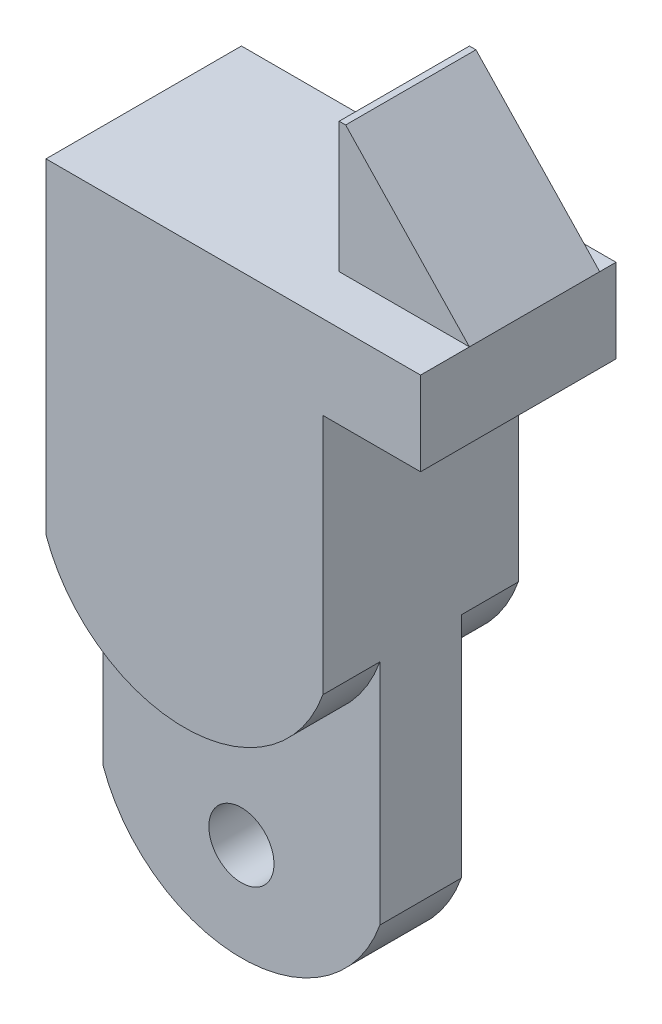
ISO-10303-21;
HEADER;
FILE_DESCRIPTION(('STEP AP214'),'2;1');
FILE_NAME('part.step','',(''),(''),'','','');
FILE_SCHEMA(('AUTOMOTIVE_DESIGN { 1 0 10303 214 1 1 1 1 }'));
ENDSEC;
DATA;
#1=APPLICATION_CONTEXT('core data for automotive mechanical design processes');
#2=APPLICATION_PROTOCOL_DEFINITION('international standard','automotive_design',2000,#1);
#3=PRODUCT_CONTEXT('',#1,'mechanical');
#4=PRODUCT('Part','Part','',(#3));
#5=PRODUCT_RELATED_PRODUCT_CATEGORY('part','',(#4));
#6=PRODUCT_DEFINITION_FORMATION('','',#4);
#7=PRODUCT_DEFINITION_CONTEXT('part definition',#1,'design');
#8=PRODUCT_DEFINITION('design','',#6,#7);
#9=PRODUCT_DEFINITION_SHAPE('','',#8);
#10=(LENGTH_UNIT() NAMED_UNIT(*) SI_UNIT(.MILLI.,.METRE.));
#11=(NAMED_UNIT(*) PLANE_ANGLE_UNIT() SI_UNIT($,.RADIAN.));
#12=(NAMED_UNIT(*) SI_UNIT($,.STERADIAN.) SOLID_ANGLE_UNIT());
#13=UNCERTAINTY_MEASURE_WITH_UNIT(LENGTH_MEASURE(1.E-05),#10,'distance_accuracy_value','');
#14=(GEOMETRIC_REPRESENTATION_CONTEXT(3) GLOBAL_UNCERTAINTY_ASSIGNED_CONTEXT((#13)) GLOBAL_UNIT_ASSIGNED_CONTEXT((#10,
#11,#12)) REPRESENTATION_CONTEXT('',''));
#15=CARTESIAN_POINT('',(0.,0.,0.));
#16=DIRECTION('',(0.,0.,1.));
#17=DIRECTION('',(1.,0.,0.));
#18=AXIS2_PLACEMENT_3D('',#15,#16,#17);
#19=CARTESIAN_POINT('',(0.,0.,6.));
#20=DIRECTION('',(0.,-1.,0.));
#21=DIRECTION('',(0.,0.,-1.));
#22=AXIS2_PLACEMENT_3D('',#19,#20,#21);
#23=PLANE('',#22);
#24=DIRECTION('',(1.,0.,0.));
#25=VECTOR('',#24,1.);
#26=CARTESIAN_POINT('',(11.5,0.,4.5));
#27=LINE('',#26,#25);
#28=CARTESIAN_POINT('',(7.5,0.,4.5));
#29=VERTEX_POINT('',#28);
#30=CARTESIAN_POINT('',(11.5,0.,4.5));
#31=VERTEX_POINT('',#30);
#32=EDGE_CURVE('E57',#29,#31,#27,.T.);
#33=ORIENTED_EDGE('',*,*,#32,.F.);
#34=DIRECTION('',(0.,0.,1.));
#35=VECTOR('',#34,1.);
#36=CARTESIAN_POINT('',(7.5,0.,0.500000000000001));
#37=LINE('',#36,#35);
#38=CARTESIAN_POINT('',(7.5,0.,0.500000000000001));
#39=VERTEX_POINT('',#38);
#40=EDGE_CURVE('E153',#39,#29,#37,.T.);
#41=ORIENTED_EDGE('',*,*,#40,.F.);
#42=DIRECTION('',(-1.,0.,0.));
#43=VECTOR('',#42,1.);
#44=CARTESIAN_POINT('',(11.5,0.,0.5));
#45=LINE('',#44,#43);
#46=CARTESIAN_POINT('',(11.5,0.,0.500000000000003));
#47=VERTEX_POINT('',#46);
#48=EDGE_CURVE('E141',#47,#39,#45,.T.);
#49=ORIENTED_EDGE('',*,*,#48,.F.);
#50=DIRECTION('',(0.,0.,-1.));
#51=VECTOR('',#50,1.);
#52=CARTESIAN_POINT('',(11.5,0.,6.));
#53=LINE('',#52,#51);
#54=CARTESIAN_POINT('',(11.5,0.,0.));
#55=VERTEX_POINT('',#54);
#56=EDGE_CURVE('E42',#47,#55,#53,.T.);
#57=ORIENTED_EDGE('',*,*,#56,.T.);
#58=DIRECTION('',(-1.,0.,0.));
#59=VECTOR('',#58,1.);
#60=CARTESIAN_POINT('',(0.,0.,0.));
#61=LINE('',#60,#59);
#62=CARTESIAN_POINT('',(0.,0.,0.));
#63=VERTEX_POINT('',#62);
#64=EDGE_CURVE('E170',#55,#63,#61,.T.);
#65=ORIENTED_EDGE('',*,*,#64,.T.);
#66=DIRECTION('',(0.,0.,-1.));
#67=VECTOR('',#66,1.);
#68=CARTESIAN_POINT('',(0.,0.,6.));
#69=LINE('',#68,#67);
#70=CARTESIAN_POINT('',(0.,0.,6.));
#71=VERTEX_POINT('',#70);
#72=EDGE_CURVE('E160',#71,#63,#69,.T.);
#73=ORIENTED_EDGE('',*,*,#72,.F.);
#74=DIRECTION('',(-1.,0.,0.));
#75=VECTOR('',#74,1.);
#76=CARTESIAN_POINT('',(0.,0.,6.));
#77=LINE('',#76,#75);
#78=CARTESIAN_POINT('',(11.5,0.,6.));
#79=VERTEX_POINT('',#78);
#80=EDGE_CURVE('E163',#79,#71,#77,.T.);
#81=ORIENTED_EDGE('',*,*,#80,.F.);
#82=EDGE_CURVE('E11',#79,#31,#53,.T.);
#83=ORIENTED_EDGE('',*,*,#82,.T.);
#84=EDGE_LOOP('',(#33,#41,#49,#57,#65,#73,#81,#83));
#85=FACE_BOUND('',#84,.T.);
#86=ADVANCED_FACE('F33',(#85),#23,.F.);
#87=CARTESIAN_POINT('',(4.25,-8.48958333333333,4.25));
#88=DIRECTION('',(0.,0.,1.));
#89=DIRECTION('',(1.,0.,0.));
#90=AXIS2_PLACEMENT_3D('',#87,#88,#89);
#91=PLANE('',#90);
#92=CARTESIAN_POINT('',(4.25,-17.,4.25));
#93=DIRECTION('',(0.,0.,-1.));
#94=DIRECTION('',(-1.,0.,0.));
#95=AXIS2_PLACEMENT_3D('',#92,#93,#94);
#96=CIRCLE('',#95,1.);
#97=CARTESIAN_POINT('',(3.25,-17.,4.25));
#98=VERTEX_POINT('',#97);
#99=EDGE_CURVE('E240',#98,#98,#96,.T.);
#100=ORIENTED_EDGE('',*,*,#99,.T.);
#101=EDGE_LOOP('',(#100));
#102=FACE_BOUND('',#101,.T.);
#103=DIRECTION('',(0.,-1.,0.));
#104=VECTOR('',#103,1.);
#105=CARTESIAN_POINT('',(0.,-10.,4.25));
#106=LINE('',#105,#104);
#107=CARTESIAN_POINT('',(0.,-10.,4.25));
#108=VERTEX_POINT('',#107);
#109=CARTESIAN_POINT('',(0.,-17.,4.25));
#110=VERTEX_POINT('',#109);
#111=EDGE_CURVE('E209',#108,#110,#106,.T.);
#112=ORIENTED_EDGE('',*,*,#111,.T.);
#113=CARTESIAN_POINT('',(4.25,-15.4895833333333,4.25));
#114=DIRECTION('',(0.,0.,-1.));
#115=DIRECTION('',(-1.,0.,0.));
#116=AXIS2_PLACEMENT_3D('',#113,#114,#115);
#117=CIRCLE('',#116,4.51041666666667);
#118=CARTESIAN_POINT('',(8.5,-17.,4.25));
#119=VERTEX_POINT('',#118);
#120=EDGE_CURVE('E233',#119,#110,#117,.T.);
#121=ORIENTED_EDGE('',*,*,#120,.F.);
#122=DIRECTION('',(0.,1.,0.));
#123=VECTOR('',#122,1.);
#124=CARTESIAN_POINT('',(8.5,-20.,4.25));
#125=LINE('',#124,#123);
#126=CARTESIAN_POINT('',(8.5,-10.,4.25));
#127=VERTEX_POINT('',#126);
#128=EDGE_CURVE('E202',#119,#127,#125,.T.);
#129=ORIENTED_EDGE('',*,*,#128,.T.);
#130=CARTESIAN_POINT('',(4.25,-8.48958333333333,4.25));
#131=DIRECTION('',(0.,0.,-1.));
#132=DIRECTION('',(1.,0.,0.));
#133=AXIS2_PLACEMENT_3D('',#130,#131,#132);
#134=CIRCLE('',#133,4.51041666666667);
#135=EDGE_CURVE('E206',#127,#108,#134,.T.);
#136=ORIENTED_EDGE('',*,*,#135,.T.);
#137=EDGE_LOOP('',(#112,#121,#129,#136));
#138=FACE_BOUND('',#137,.T.);
#139=ADVANCED_FACE('F285',(#102,#138),#91,.T.);
#140=CARTESIAN_POINT('',(0.,0.,1.75));
#141=DIRECTION('',(0.,0.,1.));
#142=DIRECTION('',(1.,0.,0.));
#143=AXIS2_PLACEMENT_3D('',#140,#141,#142);
#144=PLANE('',#143);
#145=CARTESIAN_POINT('',(4.25,-17.,1.75));
#146=DIRECTION('',(0.,0.,-1.));
#147=DIRECTION('',(-1.,0.,0.));
#148=AXIS2_PLACEMENT_3D('',#145,#146,#147);
#149=CIRCLE('',#148,1.);
#150=CARTESIAN_POINT('',(3.25,-17.,1.75));
#151=VERTEX_POINT('',#150);
#152=EDGE_CURVE('E241',#151,#151,#149,.T.);
#153=ORIENTED_EDGE('',*,*,#152,.F.);
#154=EDGE_LOOP('',(#153));
#155=FACE_BOUND('',#154,.T.);
#156=CARTESIAN_POINT('',(4.25,-15.4895833333333,1.75));
#157=DIRECTION('',(0.,0.,-1.));
#158=DIRECTION('',(-1.,0.,0.));
#159=AXIS2_PLACEMENT_3D('',#156,#157,#158);
#160=CIRCLE('',#159,4.51041666666667);
#161=CARTESIAN_POINT('',(8.5,-17.,1.75));
#162=VERTEX_POINT('',#161);
#163=CARTESIAN_POINT('',(0.,-17.,1.75));
#164=VERTEX_POINT('',#163);
#165=EDGE_CURVE('E234',#162,#164,#160,.T.);
#166=ORIENTED_EDGE('',*,*,#165,.T.);
#167=DIRECTION('',(0.,-1.,0.));
#168=VECTOR('',#167,1.);
#169=CARTESIAN_POINT('',(0.,0.,1.75));
#170=LINE('',#169,#168);
#171=CARTESIAN_POINT('',(0.,-10.,1.75));
#172=VERTEX_POINT('',#171);
#173=EDGE_CURVE('E214',#172,#164,#170,.T.);
#174=ORIENTED_EDGE('',*,*,#173,.F.);
#175=CARTESIAN_POINT('',(4.25,-8.48958333333333,1.75));
#176=DIRECTION('',(0.,0.,1.));
#177=DIRECTION('',(1.,0.,0.));
#178=AXIS2_PLACEMENT_3D('',#175,#176,#177);
#179=CIRCLE('',#178,4.51041666666667);
#180=CARTESIAN_POINT('',(8.5,-10.,1.75));
#181=VERTEX_POINT('',#180);
#182=EDGE_CURVE('E226',#181,#172,#179,.F.);
#183=ORIENTED_EDGE('',*,*,#182,.F.);
#184=DIRECTION('',(0.,-1.,0.));
#185=VECTOR('',#184,1.);
#186=CARTESIAN_POINT('',(8.5,-2.5709966238269,1.75));
#187=LINE('',#186,#185);
#188=EDGE_CURVE('E218',#181,#162,#187,.T.);
#189=ORIENTED_EDGE('',*,*,#188,.T.);
#190=EDGE_LOOP('',(#166,#174,#183,#189));
#191=FACE_BOUND('',#190,.T.);
#192=ADVANCED_FACE('F290',(#155,#191),#144,.F.);
#193=CARTESIAN_POINT('',(0.,0.,6.));
#194=DIRECTION('',(1.,0.,0.));
#195=DIRECTION('',(0.,1.,0.));
#196=AXIS2_PLACEMENT_3D('',#193,#194,#195);
#197=PLANE('',#196);
#198=DIRECTION('',(0.,0.,-1.));
#199=VECTOR('',#198,1.);
#200=CARTESIAN_POINT('',(0.,-17.,4.25));
#201=LINE('',#200,#199);
#202=EDGE_CURVE('E236',#110,#164,#201,.T.);
#203=ORIENTED_EDGE('',*,*,#202,.F.);
#204=ORIENTED_EDGE('',*,*,#111,.F.);
#205=DIRECTION('',(0.,0.,1.));
#206=VECTOR('',#205,1.);
#207=CARTESIAN_POINT('',(0.,-10.,4.25));
#208=LINE('',#207,#206);
#209=CARTESIAN_POINT('',(0.,-10.,6.));
#210=VERTEX_POINT('',#209);
#211=EDGE_CURVE('E199',#108,#210,#208,.T.);
#212=ORIENTED_EDGE('',*,*,#211,.T.);
#213=DIRECTION('',(0.,-1.,0.));
#214=VECTOR('',#213,1.);
#215=CARTESIAN_POINT('',(0.,0.,6.));
#216=LINE('',#215,#214);
#217=EDGE_CURVE('E172',#71,#210,#216,.T.);
#218=ORIENTED_EDGE('',*,*,#217,.F.);
#219=ORIENTED_EDGE('',*,*,#72,.T.);
#220=DIRECTION('',(0.,-1.,0.));
#221=VECTOR('',#220,1.);
#222=CARTESIAN_POINT('',(0.,0.,0.));
#223=LINE('',#222,#221);
#224=CARTESIAN_POINT('',(0.,-10.,0.));
#225=VERTEX_POINT('',#224);
#226=EDGE_CURVE('E174',#63,#225,#223,.T.);
#227=ORIENTED_EDGE('',*,*,#226,.T.);
#228=DIRECTION('',(0.,0.,1.));
#229=VECTOR('',#228,1.);
#230=CARTESIAN_POINT('',(0.,-10.,-35.1099936026505));
#231=LINE('',#230,#229);
#232=EDGE_CURVE('E207',#225,#172,#231,.T.);
#233=ORIENTED_EDGE('',*,*,#232,.T.);
#234=ORIENTED_EDGE('',*,*,#173,.T.);
#235=EDGE_LOOP('',(#203,#204,#212,#218,#219,#227,#233,#234));
#236=FACE_BOUND('',#235,.T.);
#237=ADVANCED_FACE('F35',(#236),#197,.F.);
#238=CARTESIAN_POINT('',(8.5,-2.5709966238269,0.));
#239=DIRECTION('',(-1.,0.,0.));
#240=DIRECTION('',(0.,-1.,0.));
#241=AXIS2_PLACEMENT_3D('',#238,#239,#240);
#242=PLANE('',#241);
#243=DIRECTION('',(0.,0.,-1.));
#244=VECTOR('',#243,1.);
#245=CARTESIAN_POINT('',(8.5,-17.,4.25));
#246=LINE('',#245,#244);
#247=EDGE_CURVE('E221',#119,#162,#246,.T.);
#248=ORIENTED_EDGE('',*,*,#247,.T.);
#249=ORIENTED_EDGE('',*,*,#188,.F.);
#250=DIRECTION('',(0.,0.,1.));
#251=VECTOR('',#250,1.);
#252=CARTESIAN_POINT('',(8.5,-10.,-35.1099936026505));
#253=LINE('',#252,#251);
#254=CARTESIAN_POINT('',(8.5,-10.,0.));
#255=VERTEX_POINT('',#254);
#256=EDGE_CURVE('E224',#255,#181,#253,.T.);
#257=ORIENTED_EDGE('',*,*,#256,.F.);
#258=DIRECTION('',(0.,-1.,0.));
#259=VECTOR('',#258,1.);
#260=CARTESIAN_POINT('',(8.5,-2.5709966238269,0.));
#261=LINE('',#260,#259);
#262=CARTESIAN_POINT('',(8.5,-2.5709966238269,0.));
#263=VERTEX_POINT('',#262);
#264=EDGE_CURVE('E185',#263,#255,#261,.T.);
#265=ORIENTED_EDGE('',*,*,#264,.F.);
#266=DIRECTION('',(0.,0.,1.));
#267=VECTOR('',#266,1.);
#268=CARTESIAN_POINT('',(8.5,-2.5709966238269,0.));
#269=LINE('',#268,#267);
#270=CARTESIAN_POINT('',(8.5,-2.5709966238269,6.));
#271=VERTEX_POINT('',#270);
#272=EDGE_CURVE('E177',#263,#271,#269,.T.);
#273=ORIENTED_EDGE('',*,*,#272,.T.);
#274=DIRECTION('',(0.,-1.,0.));
#275=VECTOR('',#274,1.);
#276=CARTESIAN_POINT('',(8.5,-2.5709966238269,6.));
#277=LINE('',#276,#275);
#278=CARTESIAN_POINT('',(8.5,-10.,6.));
#279=VERTEX_POINT('',#278);
#280=EDGE_CURVE('E187',#271,#279,#277,.T.);
#281=ORIENTED_EDGE('',*,*,#280,.T.);
#282=DIRECTION('',(0.,0.,1.));
#283=VECTOR('',#282,1.);
#284=CARTESIAN_POINT('',(8.5,-10.,4.25));
#285=LINE('',#284,#283);
#286=EDGE_CURVE('E194',#127,#279,#285,.T.);
#287=ORIENTED_EDGE('',*,*,#286,.F.);
#288=ORIENTED_EDGE('',*,*,#128,.F.);
#289=EDGE_LOOP('',(#248,#249,#257,#265,#273,#281,#287,#288));
#290=FACE_BOUND('',#289,.T.);
#291=ADVANCED_FACE('F304',(#290),#242,.F.);
#292=CARTESIAN_POINT('',(0.,0.,0.));
#293=DIRECTION('',(0.,0.,1.));
#294=DIRECTION('',(1.,0.,0.));
#295=AXIS2_PLACEMENT_3D('',#292,#293,#294);
#296=PLANE('',#295);
#297=CARTESIAN_POINT('',(4.25,-8.48958333333333,0.));
#298=DIRECTION('',(0.,0.,1.));
#299=DIRECTION('',(1.,0.,0.));
#300=AXIS2_PLACEMENT_3D('',#297,#298,#299);
#301=CIRCLE('',#300,4.51041666666667);
#302=EDGE_CURVE('E217',#255,#225,#301,.F.);
#303=ORIENTED_EDGE('',*,*,#302,.T.);
#304=ORIENTED_EDGE('',*,*,#226,.F.);
#305=ORIENTED_EDGE('',*,*,#64,.F.);
#306=DIRECTION('',(0.,1.,0.));
#307=VECTOR('',#306,1.);
#308=CARTESIAN_POINT('',(11.5,0.,0.));
#309=LINE('',#308,#307);
#310=CARTESIAN_POINT('',(11.5,-2.5709966238269,0.));
#311=VERTEX_POINT('',#310);
#312=EDGE_CURVE('E158',#311,#55,#309,.T.);
#313=ORIENTED_EDGE('',*,*,#312,.F.);
#314=DIRECTION('',(-1.,0.,0.));
#315=VECTOR('',#314,1.);
#316=CARTESIAN_POINT('',(11.5,-2.5709966238269,0.));
#317=LINE('',#316,#315);
#318=EDGE_CURVE('E190',#311,#263,#317,.T.);
#319=ORIENTED_EDGE('',*,*,#318,.T.);
#320=ORIENTED_EDGE('',*,*,#264,.T.);
#321=EDGE_LOOP('',(#303,#304,#305,#313,#319,#320));
#322=FACE_BOUND('',#321,.T.);
#323=ADVANCED_FACE('F294',(#322),#296,.F.);
#324=CARTESIAN_POINT('',(11.5,0.,6.));
#325=DIRECTION('',(-1.,0.,0.));
#326=DIRECTION('',(0.,-1.,0.));
#327=AXIS2_PLACEMENT_3D('',#324,#325,#326);
#328=PLANE('',#327);
#329=ORIENTED_EDGE('',*,*,#56,.F.);
#330=DIRECTION('',(0.,0.,1.));
#331=VECTOR('',#330,1.);
#332=CARTESIAN_POINT('',(11.5,0.,0.500000000000003));
#333=LINE('',#332,#331);
#334=EDGE_CURVE('E134',#47,#31,#333,.T.);
#335=ORIENTED_EDGE('',*,*,#334,.T.);
#336=ORIENTED_EDGE('',*,*,#82,.F.);
#337=DIRECTION('',(0.,1.,0.));
#338=VECTOR('',#337,1.);
#339=CARTESIAN_POINT('',(11.5,0.,6.));
#340=LINE('',#339,#338);
#341=CARTESIAN_POINT('',(11.5,-2.5709966238269,6.));
#342=VERTEX_POINT('',#341);
#343=EDGE_CURVE('E179',#342,#79,#340,.T.);
#344=ORIENTED_EDGE('',*,*,#343,.F.);
#345=DIRECTION('',(0.,0.,1.));
#346=VECTOR('',#345,1.);
#347=CARTESIAN_POINT('',(11.5,-2.5709966238269,0.));
#348=LINE('',#347,#346);
#349=EDGE_CURVE('E183',#311,#342,#348,.T.);
#350=ORIENTED_EDGE('',*,*,#349,.F.);
#351=ORIENTED_EDGE('',*,*,#312,.T.);
#352=EDGE_LOOP('',(#329,#335,#336,#344,#350,#351));
#353=FACE_BOUND('',#352,.T.);
#354=ADVANCED_FACE('F155',(#353),#328,.F.);
#355=CARTESIAN_POINT('',(0.,0.,6.));
#356=DIRECTION('',(0.,0.,1.));
#357=DIRECTION('',(1.,0.,0.));
#358=AXIS2_PLACEMENT_3D('',#355,#356,#357);
#359=PLANE('',#358);
#360=CARTESIAN_POINT('',(4.25,-8.48958333333333,6.));
#361=DIRECTION('',(0.,0.,-1.));
#362=DIRECTION('',(1.,0.,0.));
#363=AXIS2_PLACEMENT_3D('',#360,#361,#362);
#364=CIRCLE('',#363,4.51041666666667);
#365=EDGE_CURVE('E204',#279,#210,#364,.T.);
#366=ORIENTED_EDGE('',*,*,#365,.F.);
#367=ORIENTED_EDGE('',*,*,#280,.F.);
#368=DIRECTION('',(-1.,0.,0.));
#369=VECTOR('',#368,1.);
#370=CARTESIAN_POINT('',(11.5,-2.5709966238269,6.));
#371=LINE('',#370,#369);
#372=EDGE_CURVE('E191',#342,#271,#371,.T.);
#373=ORIENTED_EDGE('',*,*,#372,.F.);
#374=ORIENTED_EDGE('',*,*,#343,.T.);
#375=ORIENTED_EDGE('',*,*,#80,.T.);
#376=ORIENTED_EDGE('',*,*,#217,.T.);
#377=EDGE_LOOP('',(#366,#367,#373,#374,#375,#376));
#378=FACE_BOUND('',#377,.T.);
#379=ADVANCED_FACE('F297',(#378),#359,.T.);
#380=CARTESIAN_POINT('',(11.5,-2.5709966238269,0.));
#381=DIRECTION('',(0.,1.,0.));
#382=DIRECTION('',(-1.,0.,0.));
#383=AXIS2_PLACEMENT_3D('',#380,#381,#382);
#384=PLANE('',#383);
#385=ORIENTED_EDGE('',*,*,#372,.T.);
#386=ORIENTED_EDGE('',*,*,#272,.F.);
#387=ORIENTED_EDGE('',*,*,#318,.F.);
#388=ORIENTED_EDGE('',*,*,#349,.T.);
#389=EDGE_LOOP('',(#385,#386,#387,#388));
#390=FACE_BOUND('',#389,.T.);
#391=ADVANCED_FACE('F302',(#390),#384,.F.);
#392=CARTESIAN_POINT('',(4.25,-8.48958333333333,4.25));
#393=DIRECTION('',(0.,0.,1.));
#394=DIRECTION('',(1.,0.,0.));
#395=AXIS2_PLACEMENT_3D('',#392,#393,#394);
#396=CYLINDRICAL_SURFACE('',#395,4.51041666666667);
#397=ORIENTED_EDGE('',*,*,#365,.T.);
#398=ORIENTED_EDGE('',*,*,#211,.F.);
#399=ORIENTED_EDGE('',*,*,#135,.F.);
#400=ORIENTED_EDGE('',*,*,#286,.T.);
#401=EDGE_LOOP('',(#397,#398,#399,#400));
#402=FACE_BOUND('',#401,.T.);
#403=ADVANCED_FACE('F337',(#402),#396,.T.);
#404=CARTESIAN_POINT('',(4.25,-8.48958333333333,-35.1099936026505));
#405=DIRECTION('',(0.,0.,1.));
#406=DIRECTION('',(1.,0.,0.));
#407=AXIS2_PLACEMENT_3D('',#404,#405,#406);
#408=CYLINDRICAL_SURFACE('',#407,4.51041666666667);
#409=ORIENTED_EDGE('',*,*,#302,.F.);
#410=ORIENTED_EDGE('',*,*,#256,.T.);
#411=ORIENTED_EDGE('',*,*,#182,.T.);
#412=ORIENTED_EDGE('',*,*,#232,.F.);
#413=EDGE_LOOP('',(#409,#410,#411,#412));
#414=FACE_BOUND('',#413,.T.);
#415=ADVANCED_FACE('F329',(#414),#408,.T.);
#416=CARTESIAN_POINT('',(4.25,-15.4895833333333,4.25));
#417=DIRECTION('',(0.,0.,-1.));
#418=DIRECTION('',(-1.,0.,0.));
#419=AXIS2_PLACEMENT_3D('',#416,#417,#418);
#420=CYLINDRICAL_SURFACE('',#419,4.51041666666667);
#421=ORIENTED_EDGE('',*,*,#165,.F.);
#422=ORIENTED_EDGE('',*,*,#247,.F.);
#423=ORIENTED_EDGE('',*,*,#120,.T.);
#424=ORIENTED_EDGE('',*,*,#202,.T.);
#425=EDGE_LOOP('',(#421,#422,#423,#424));
#426=FACE_BOUND('',#425,.T.);
#427=ADVANCED_FACE('F344',(#426),#420,.T.);
#428=CARTESIAN_POINT('',(4.25,-17.,4.25));
#429=DIRECTION('',(0.,0.,-1.));
#430=DIRECTION('',(-1.,0.,0.));
#431=AXIS2_PLACEMENT_3D('',#428,#429,#430);
#432=CYLINDRICAL_SURFACE('',#431,1.);
#433=ORIENTED_EDGE('',*,*,#99,.F.);
#434=EDGE_LOOP('',(#433));
#435=FACE_BOUND('',#434,.T.);
#436=ORIENTED_EDGE('',*,*,#152,.T.);
#437=EDGE_LOOP('',(#436));
#438=FACE_BOUND('',#437,.T.);
#439=ADVANCED_FACE('F353',(#435,#438),#432,.F.);
#440=CARTESIAN_POINT('',(11.5,4.,0.5));
#441=DIRECTION('',(0.,0.,1.));
#442=DIRECTION('',(1.,0.,0.));
#443=AXIS2_PLACEMENT_3D('',#440,#441,#442);
#444=PLANE('',#443);
#445=DIRECTION('',(-1.,0.,0.));
#446=VECTOR('',#445,1.);
#447=CARTESIAN_POINT('',(11.5,4.,0.5));
#448=LINE('',#447,#446);
#449=CARTESIAN_POINT('',(7.7,4.,0.500000000000001));
#450=VERTEX_POINT('',#449);
#451=CARTESIAN_POINT('',(7.5,4.,0.500000000000001));
#452=VERTEX_POINT('',#451);
#453=EDGE_CURVE('E151',#450,#452,#448,.T.);
#454=ORIENTED_EDGE('',*,*,#453,.F.);
#455=DIRECTION('',(0.688749461914693,-0.724999433594414,0.));
#456=VECTOR('',#455,1.);
#457=CARTESIAN_POINT('',(7.7,4.,0.500000000000003));
#458=LINE('',#457,#456);
#459=EDGE_CURVE('E50',#450,#47,#458,.T.);
#460=ORIENTED_EDGE('',*,*,#459,.T.);
#461=ORIENTED_EDGE('',*,*,#48,.T.);
#462=DIRECTION('',(0.,-1.,0.));
#463=VECTOR('',#462,1.);
#464=CARTESIAN_POINT('',(7.5,4.,0.500000000000001));
#465=LINE('',#464,#463);
#466=EDGE_CURVE('E244',#452,#39,#465,.T.);
#467=ORIENTED_EDGE('',*,*,#466,.F.);
#468=EDGE_LOOP('',(#454,#460,#461,#467));
#469=FACE_BOUND('',#468,.T.);
#470=ADVANCED_FACE('F148',(#469),#444,.F.);
#471=CARTESIAN_POINT('',(7.5,4.,0.500000000000001));
#472=DIRECTION('',(1.,0.,0.));
#473=DIRECTION('',(0.,0.,-1.));
#474=AXIS2_PLACEMENT_3D('',#471,#472,#473);
#475=PLANE('',#474);
#476=ORIENTED_EDGE('',*,*,#40,.T.);
#477=DIRECTION('',(0.,-1.,0.));
#478=VECTOR('',#477,1.);
#479=CARTESIAN_POINT('',(7.5,4.,4.5));
#480=LINE('',#479,#478);
#481=CARTESIAN_POINT('',(7.5,4.,4.5));
#482=VERTEX_POINT('',#481);
#483=EDGE_CURVE('E248',#482,#29,#480,.T.);
#484=ORIENTED_EDGE('',*,*,#483,.F.);
#485=DIRECTION('',(0.,0.,1.));
#486=VECTOR('',#485,1.);
#487=CARTESIAN_POINT('',(7.5,4.,0.500000000000001));
#488=LINE('',#487,#486);
#489=EDGE_CURVE('E263',#452,#482,#488,.T.);
#490=ORIENTED_EDGE('',*,*,#489,.F.);
#491=ORIENTED_EDGE('',*,*,#466,.T.);
#492=EDGE_LOOP('',(#476,#484,#490,#491));
#493=FACE_BOUND('',#492,.T.);
#494=ADVANCED_FACE('F267',(#493),#475,.F.);
#495=CARTESIAN_POINT('',(11.5,4.,4.5));
#496=DIRECTION('',(0.,0.,-1.));
#497=DIRECTION('',(-1.,0.,0.));
#498=AXIS2_PLACEMENT_3D('',#495,#496,#497);
#499=PLANE('',#498);
#500=ORIENTED_EDGE('',*,*,#32,.T.);
#501=DIRECTION('',(0.688749461914693,-0.724999433594414,0.));
#502=VECTOR('',#501,1.);
#503=CARTESIAN_POINT('',(7.7,4.,4.5));
#504=LINE('',#503,#502);
#505=CARTESIAN_POINT('',(7.7,4.,4.5));
#506=VERTEX_POINT('',#505);
#507=EDGE_CURVE('E137',#506,#31,#504,.T.);
#508=ORIENTED_EDGE('',*,*,#507,.F.);
#509=DIRECTION('',(1.,0.,0.));
#510=VECTOR('',#509,1.);
#511=CARTESIAN_POINT('',(11.5,4.,4.5));
#512=LINE('',#511,#510);
#513=EDGE_CURVE('E251',#482,#506,#512,.T.);
#514=ORIENTED_EDGE('',*,*,#513,.F.);
#515=ORIENTED_EDGE('',*,*,#483,.T.);
#516=EDGE_LOOP('',(#500,#508,#514,#515));
#517=FACE_BOUND('',#516,.T.);
#518=ADVANCED_FACE('F270',(#517),#499,.F.);
#519=CARTESIAN_POINT('',(0.,4.,0.));
#520=DIRECTION('',(0.,-1.,0.));
#521=DIRECTION('',(0.,0.,-1.));
#522=AXIS2_PLACEMENT_3D('',#519,#520,#521);
#523=PLANE('',#522);
#524=ORIENTED_EDGE('',*,*,#513,.T.);
#525=DIRECTION('',(0.,0.,1.));
#526=VECTOR('',#525,1.);
#527=CARTESIAN_POINT('',(7.7,4.,0.500000000000003));
#528=LINE('',#527,#526);
#529=EDGE_CURVE('E142',#450,#506,#528,.T.);
#530=ORIENTED_EDGE('',*,*,#529,.F.);
#531=ORIENTED_EDGE('',*,*,#453,.T.);
#532=ORIENTED_EDGE('',*,*,#489,.T.);
#533=EDGE_LOOP('',(#524,#530,#531,#532));
#534=FACE_BOUND('',#533,.T.);
#535=ADVANCED_FACE('F275',(#534),#523,.F.);
#536=CARTESIAN_POINT('',(7.7,4.,0.500000000000003));
#537=DIRECTION('',(-0.724999433594414,-0.688749461914693,0.));
#538=DIRECTION('',(0.688749461914693,-0.724999433594414,0.));
#539=AXIS2_PLACEMENT_3D('',#536,#537,#538);
#540=PLANE('',#539);
#541=ORIENTED_EDGE('',*,*,#507,.T.);
#542=ORIENTED_EDGE('',*,*,#334,.F.);
#543=ORIENTED_EDGE('',*,*,#459,.F.);
#544=ORIENTED_EDGE('',*,*,#529,.T.);
#545=EDGE_LOOP('',(#541,#542,#543,#544));
#546=FACE_BOUND('',#545,.T.);
#547=ADVANCED_FACE('F135',(#546),#540,.F.);
#548=CLOSED_SHELL('',(#86,#139,#192,#237,#291,#323,#354,#379,#391,#403,#415,#427,#439,#470,#494,
#518,#535,#547));
#549=MANIFOLD_SOLID_BREP('B2',#548);
#550=ADVANCED_BREP_SHAPE_REPRESENTATION('',(#18,#549),#14);
#551=SHAPE_DEFINITION_REPRESENTATION(#9,#550);
ENDSEC;
END-ISO-10303-21;
